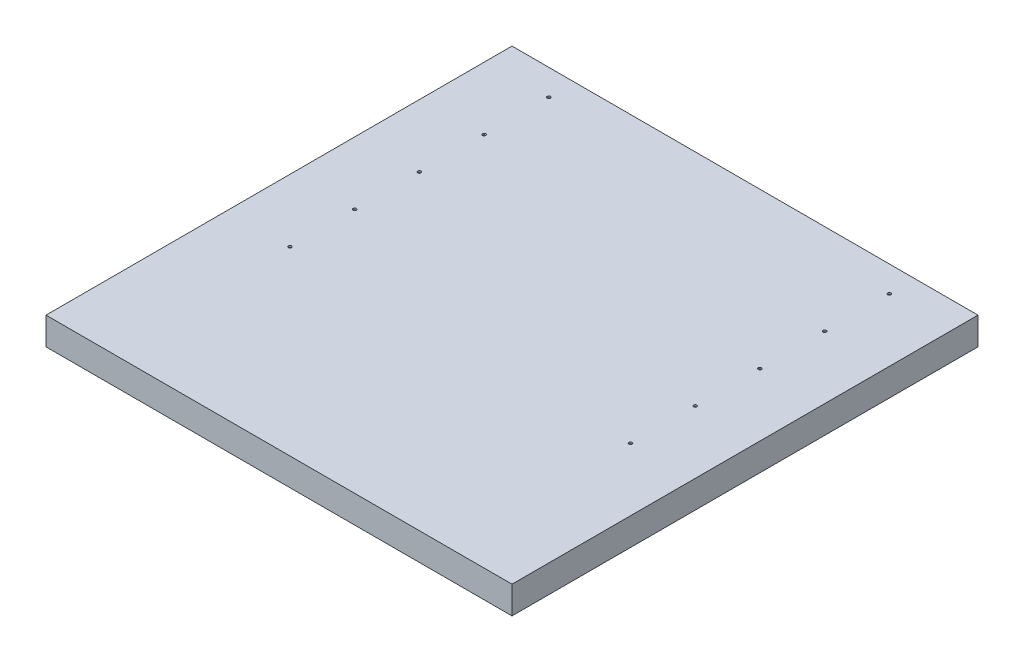
ISO-10303-21;
HEADER;
FILE_DESCRIPTION(('STEP AP214'),'2;1');
FILE_NAME('part.step','',(''),(''),'','','');
FILE_SCHEMA(('AUTOMOTIVE_DESIGN { 1 0 10303 214 1 1 1 1 }'));
ENDSEC;
DATA;
#1=APPLICATION_CONTEXT('core data for automotive mechanical design processes');
#2=APPLICATION_PROTOCOL_DEFINITION('international standard','automotive_design',2000,#1);
#3=PRODUCT_CONTEXT('',#1,'mechanical');
#4=PRODUCT('Part','Part','',(#3));
#5=PRODUCT_RELATED_PRODUCT_CATEGORY('part','',(#4));
#6=PRODUCT_DEFINITION_FORMATION('','',#4);
#7=PRODUCT_DEFINITION_CONTEXT('part definition',#1,'design');
#8=PRODUCT_DEFINITION('design','',#6,#7);
#9=PRODUCT_DEFINITION_SHAPE('','',#8);
#10=(LENGTH_UNIT() NAMED_UNIT(*) SI_UNIT(.MILLI.,.METRE.));
#11=(NAMED_UNIT(*) PLANE_ANGLE_UNIT() SI_UNIT($,.RADIAN.));
#12=(NAMED_UNIT(*) SI_UNIT($,.STERADIAN.) SOLID_ANGLE_UNIT());
#13=UNCERTAINTY_MEASURE_WITH_UNIT(LENGTH_MEASURE(1.E-05),#10,'distance_accuracy_value','');
#14=(GEOMETRIC_REPRESENTATION_CONTEXT(3) GLOBAL_UNCERTAINTY_ASSIGNED_CONTEXT((#13)) GLOBAL_UNIT_ASSIGNED_CONTEXT((#10,
#11,#12)) REPRESENTATION_CONTEXT('',''));
#15=CARTESIAN_POINT('',(0.,0.,0.));
#16=DIRECTION('',(0.,0.,1.));
#17=DIRECTION('',(1.,0.,0.));
#18=AXIS2_PLACEMENT_3D('',#15,#16,#17);
#19=CARTESIAN_POINT('',(0.,3.175,0.));
#20=DIRECTION('',(0.,-1.,0.));
#21=DIRECTION('',(0.,0.,-1.));
#22=AXIS2_PLACEMENT_3D('',#19,#20,#21);
#23=PLANE('',#22);
#24=DIRECTION('',(0.,0.,-1.));
#25=VECTOR('',#24,1.);
#26=CARTESIAN_POINT('',(457.2,3.175,457.2));
#27=LINE('',#26,#25);
#28=CARTESIAN_POINT('',(457.2,3.175,457.2));
#29=VERTEX_POINT('',#28);
#30=CARTESIAN_POINT('',(457.2,3.175,-457.2));
#31=VERTEX_POINT('',#30);
#32=EDGE_CURVE('E206',#29,#31,#27,.T.);
#33=ORIENTED_EDGE('',*,*,#32,.T.);
#34=DIRECTION('',(-1.,0.,0.));
#35=VECTOR('',#34,1.);
#36=CARTESIAN_POINT('',(-457.2,3.175,-457.2));
#37=LINE('',#36,#35);
#38=CARTESIAN_POINT('',(-457.2,3.175,-457.2));
#39=VERTEX_POINT('',#38);
#40=EDGE_CURVE('E211',#31,#39,#37,.T.);
#41=ORIENTED_EDGE('',*,*,#40,.T.);
#42=DIRECTION('',(0.,0.,1.));
#43=VECTOR('',#42,1.);
#44=CARTESIAN_POINT('',(-457.2,3.175,457.2));
#45=LINE('',#44,#43);
#46=CARTESIAN_POINT('',(-457.2,3.175,457.2));
#47=VERTEX_POINT('',#46);
#48=EDGE_CURVE('E213',#39,#47,#45,.T.);
#49=ORIENTED_EDGE('',*,*,#48,.T.);
#50=DIRECTION('',(1.,0.,0.));
#51=VECTOR('',#50,1.);
#52=CARTESIAN_POINT('',(-457.2,3.175,457.2));
#53=LINE('',#52,#51);
#54=EDGE_CURVE('E215',#47,#29,#53,.T.);
#55=ORIENTED_EDGE('',*,*,#54,.T.);
#56=EDGE_LOOP('',(#33,#41,#49,#55));
#57=FACE_BOUND('',#56,.T.);
#58=CARTESIAN_POINT('',(-334.137,3.175,-406.4));
#59=DIRECTION('',(0.,1.,0.));
#60=DIRECTION('',(0.,0.,1.));
#61=AXIS2_PLACEMENT_3D('',#58,#59,#60);
#62=CIRCLE('',#61,3.17499999999997);
#63=CARTESIAN_POINT('',(-334.137,3.175,-403.225));
#64=VERTEX_POINT('',#63);
#65=EDGE_CURVE('E203',#64,#64,#62,.T.);
#66=ORIENTED_EDGE('',*,*,#65,.F.);
#67=EDGE_LOOP('',(#66));
#68=FACE_BOUND('',#67,.T.);
#69=CARTESIAN_POINT('',(334.136999999995,3.175,101.6));
#70=DIRECTION('',(0.,1.,0.));
#71=DIRECTION('',(0.,0.,-1.));
#72=AXIS2_PLACEMENT_3D('',#69,#70,#71);
#73=CIRCLE('',#72,3.17499999999997);
#74=CARTESIAN_POINT('',(334.136999999995,3.175,98.4250000000001));
#75=VERTEX_POINT('',#74);
#76=EDGE_CURVE('E197',#75,#75,#73,.T.);
#77=ORIENTED_EDGE('',*,*,#76,.F.);
#78=EDGE_LOOP('',(#77));
#79=FACE_BOUND('',#78,.T.);
#80=CARTESIAN_POINT('',(-334.136999999999,3.175,-279.4));
#81=DIRECTION('',(0.,1.,0.));
#82=DIRECTION('',(0.,0.,1.));
#83=AXIS2_PLACEMENT_3D('',#80,#81,#82);
#84=CIRCLE('',#83,3.17499999999997);
#85=CARTESIAN_POINT('',(-334.136999999999,3.175,-276.225));
#86=VERTEX_POINT('',#85);
#87=EDGE_CURVE('E191',#86,#86,#84,.T.);
#88=ORIENTED_EDGE('',*,*,#87,.F.);
#89=EDGE_LOOP('',(#88));
#90=FACE_BOUND('',#89,.T.);
#91=CARTESIAN_POINT('',(-334.136999999997,3.175,-152.4));
#92=DIRECTION('',(0.,1.,0.));
#93=DIRECTION('',(0.,0.,1.));
#94=AXIS2_PLACEMENT_3D('',#91,#92,#93);
#95=CIRCLE('',#94,3.17499999999997);
#96=CARTESIAN_POINT('',(-334.136999999997,3.175,-149.225));
#97=VERTEX_POINT('',#96);
#98=EDGE_CURVE('E185',#97,#97,#95,.T.);
#99=ORIENTED_EDGE('',*,*,#98,.F.);
#100=EDGE_LOOP('',(#99));
#101=FACE_BOUND('',#100,.T.);
#102=CARTESIAN_POINT('',(-334.136999999996,3.175,-25.4));
#103=DIRECTION('',(0.,1.,0.));
#104=DIRECTION('',(0.,0.,1.));
#105=AXIS2_PLACEMENT_3D('',#102,#103,#104);
#106=CIRCLE('',#105,3.17499999999997);
#107=CARTESIAN_POINT('',(-334.136999999996,3.175,-22.225));
#108=VERTEX_POINT('',#107);
#109=EDGE_CURVE('E179',#108,#108,#106,.T.);
#110=ORIENTED_EDGE('',*,*,#109,.F.);
#111=EDGE_LOOP('',(#110));
#112=FACE_BOUND('',#111,.T.);
#113=CARTESIAN_POINT('',(-334.136999999995,3.175,101.6));
#114=DIRECTION('',(0.,1.,0.));
#115=DIRECTION('',(0.,0.,1.));
#116=AXIS2_PLACEMENT_3D('',#113,#114,#115);
#117=CIRCLE('',#116,3.17499999999997);
#118=CARTESIAN_POINT('',(-334.136999999995,3.175,104.775));
#119=VERTEX_POINT('',#118);
#120=EDGE_CURVE('E173',#119,#119,#117,.T.);
#121=ORIENTED_EDGE('',*,*,#120,.F.);
#122=EDGE_LOOP('',(#121));
#123=FACE_BOUND('',#122,.T.);
#124=CARTESIAN_POINT('',(334.136999999996,3.175,-25.4));
#125=DIRECTION('',(0.,1.,0.));
#126=DIRECTION('',(0.,0.,-1.));
#127=AXIS2_PLACEMENT_3D('',#124,#125,#126);
#128=CIRCLE('',#127,3.17499999999997);
#129=CARTESIAN_POINT('',(334.136999999996,3.175,-28.5749999999999));
#130=VERTEX_POINT('',#129);
#131=EDGE_CURVE('E167',#130,#130,#128,.T.);
#132=ORIENTED_EDGE('',*,*,#131,.F.);
#133=EDGE_LOOP('',(#132));
#134=FACE_BOUND('',#133,.T.);
#135=CARTESIAN_POINT('',(334.136999999997,3.175,-152.4));
#136=DIRECTION('',(0.,1.,0.));
#137=DIRECTION('',(0.,0.,-1.));
#138=AXIS2_PLACEMENT_3D('',#135,#136,#137);
#139=CIRCLE('',#138,3.17499999999997);
#140=CARTESIAN_POINT('',(334.136999999997,3.175,-155.575));
#141=VERTEX_POINT('',#140);
#142=EDGE_CURVE('E161',#141,#141,#139,.T.);
#143=ORIENTED_EDGE('',*,*,#142,.F.);
#144=EDGE_LOOP('',(#143));
#145=FACE_BOUND('',#144,.T.);
#146=CARTESIAN_POINT('',(334.136999999999,3.175,-279.4));
#147=DIRECTION('',(0.,1.,0.));
#148=DIRECTION('',(0.,0.,-1.));
#149=AXIS2_PLACEMENT_3D('',#146,#147,#148);
#150=CIRCLE('',#149,3.17499999999997);
#151=CARTESIAN_POINT('',(334.136999999999,3.175,-282.575));
#152=VERTEX_POINT('',#151);
#153=EDGE_CURVE('E155',#152,#152,#150,.T.);
#154=ORIENTED_EDGE('',*,*,#153,.F.);
#155=EDGE_LOOP('',(#154));
#156=FACE_BOUND('',#155,.T.);
#157=CARTESIAN_POINT('',(334.137,3.175,-406.4));
#158=DIRECTION('',(0.,1.,0.));
#159=DIRECTION('',(0.,0.,-1.));
#160=AXIS2_PLACEMENT_3D('',#157,#158,#159);
#161=CIRCLE('',#160,3.17499999999997);
#162=CARTESIAN_POINT('',(334.137,3.175,-409.575));
#163=VERTEX_POINT('',#162);
#164=EDGE_CURVE('E149',#163,#163,#161,.T.);
#165=ORIENTED_EDGE('',*,*,#164,.F.);
#166=EDGE_LOOP('',(#165));
#167=FACE_BOUND('',#166,.T.);
#168=ADVANCED_FACE('F37',(#57,#68,#79,#90,#101,#112,#123,#134,#145,#156,#167),#23,.F.);
#169=CARTESIAN_POINT('',(0.,0.,0.));
#170=DIRECTION('',(0.,-1.,0.));
#171=DIRECTION('',(0.,0.,-1.));
#172=AXIS2_PLACEMENT_3D('',#169,#170,#171);
#173=PLANE('',#172);
#174=DIRECTION('',(0.,0.,-1.));
#175=VECTOR('',#174,1.);
#176=CARTESIAN_POINT('',(-454.025,0.,-454.025));
#177=LINE('',#176,#175);
#178=CARTESIAN_POINT('',(-454.025,0.,454.025));
#179=VERTEX_POINT('',#178);
#180=CARTESIAN_POINT('',(-454.025,0.,-454.025));
#181=VERTEX_POINT('',#180);
#182=EDGE_CURVE('E52',#179,#181,#177,.T.);
#183=ORIENTED_EDGE('',*,*,#182,.T.);
#184=DIRECTION('',(1.,0.,0.));
#185=VECTOR('',#184,1.);
#186=CARTESIAN_POINT('',(454.025,0.,-454.025));
#187=LINE('',#186,#185);
#188=CARTESIAN_POINT('',(454.025,0.,-454.025));
#189=VERTEX_POINT('',#188);
#190=EDGE_CURVE('E56',#181,#189,#187,.T.);
#191=ORIENTED_EDGE('',*,*,#190,.T.);
#192=DIRECTION('',(0.,0.,1.));
#193=VECTOR('',#192,1.);
#194=CARTESIAN_POINT('',(454.025,0.,454.025));
#195=LINE('',#194,#193);
#196=CARTESIAN_POINT('',(454.025,0.,454.025));
#197=VERTEX_POINT('',#196);
#198=EDGE_CURVE('E129',#189,#197,#195,.T.);
#199=ORIENTED_EDGE('',*,*,#198,.T.);
#200=DIRECTION('',(-1.,0.,0.));
#201=VECTOR('',#200,1.);
#202=CARTESIAN_POINT('',(-454.025,0.,454.025));
#203=LINE('',#202,#201);
#204=EDGE_CURVE('E110',#197,#179,#203,.T.);
#205=ORIENTED_EDGE('',*,*,#204,.T.);
#206=EDGE_LOOP('',(#183,#191,#199,#205));
#207=FACE_BOUND('',#206,.T.);
#208=CARTESIAN_POINT('',(334.136999999999,0.,-279.4));
#209=DIRECTION('',(0.,1.,0.));
#210=DIRECTION('',(0.,0.,-1.));
#211=AXIS2_PLACEMENT_3D('',#208,#209,#210);
#212=CIRCLE('',#211,3.17499999999997);
#213=CARTESIAN_POINT('',(334.136999999999,0.,-282.575));
#214=VERTEX_POINT('',#213);
#215=EDGE_CURVE('E152',#214,#214,#212,.T.);
#216=ORIENTED_EDGE('',*,*,#215,.T.);
#217=EDGE_LOOP('',(#216));
#218=FACE_BOUND('',#217,.T.);
#219=CARTESIAN_POINT('',(334.136999999996,0.,-25.4));
#220=DIRECTION('',(0.,1.,0.));
#221=DIRECTION('',(0.,0.,-1.));
#222=AXIS2_PLACEMENT_3D('',#219,#220,#221);
#223=CIRCLE('',#222,3.17499999999997);
#224=CARTESIAN_POINT('',(334.136999999996,0.,-28.5749999999999));
#225=VERTEX_POINT('',#224);
#226=EDGE_CURVE('E164',#225,#225,#223,.T.);
#227=ORIENTED_EDGE('',*,*,#226,.T.);
#228=EDGE_LOOP('',(#227));
#229=FACE_BOUND('',#228,.T.);
#230=CARTESIAN_POINT('',(-334.136999999996,0.,-25.4));
#231=DIRECTION('',(0.,1.,0.));
#232=DIRECTION('',(0.,0.,1.));
#233=AXIS2_PLACEMENT_3D('',#230,#231,#232);
#234=CIRCLE('',#233,3.17499999999997);
#235=CARTESIAN_POINT('',(-334.136999999996,0.,-22.225));
#236=VERTEX_POINT('',#235);
#237=EDGE_CURVE('E176',#236,#236,#234,.T.);
#238=ORIENTED_EDGE('',*,*,#237,.T.);
#239=EDGE_LOOP('',(#238));
#240=FACE_BOUND('',#239,.T.);
#241=CARTESIAN_POINT('',(-334.136999999999,0.,-279.4));
#242=DIRECTION('',(0.,1.,0.));
#243=DIRECTION('',(0.,0.,1.));
#244=AXIS2_PLACEMENT_3D('',#241,#242,#243);
#245=CIRCLE('',#244,3.17499999999997);
#246=CARTESIAN_POINT('',(-334.136999999999,0.,-276.225));
#247=VERTEX_POINT('',#246);
#248=EDGE_CURVE('E188',#247,#247,#245,.T.);
#249=ORIENTED_EDGE('',*,*,#248,.T.);
#250=EDGE_LOOP('',(#249));
#251=FACE_BOUND('',#250,.T.);
#252=CARTESIAN_POINT('',(-334.137,0.,-406.4));
#253=DIRECTION('',(0.,1.,0.));
#254=DIRECTION('',(0.,0.,1.));
#255=AXIS2_PLACEMENT_3D('',#252,#253,#254);
#256=CIRCLE('',#255,3.17499999999997);
#257=CARTESIAN_POINT('',(-334.137,0.,-403.225));
#258=VERTEX_POINT('',#257);
#259=EDGE_CURVE('E200',#258,#258,#256,.T.);
#260=ORIENTED_EDGE('',*,*,#259,.T.);
#261=EDGE_LOOP('',(#260));
#262=FACE_BOUND('',#261,.T.);
#263=CARTESIAN_POINT('',(334.136999999995,0.,101.6));
#264=DIRECTION('',(0.,1.,0.));
#265=DIRECTION('',(0.,0.,-1.));
#266=AXIS2_PLACEMENT_3D('',#263,#264,#265);
#267=CIRCLE('',#266,3.17499999999997);
#268=CARTESIAN_POINT('',(334.136999999995,0.,98.4250000000001));
#269=VERTEX_POINT('',#268);
#270=EDGE_CURVE('E194',#269,#269,#267,.T.);
#271=ORIENTED_EDGE('',*,*,#270,.T.);
#272=EDGE_LOOP('',(#271));
#273=FACE_BOUND('',#272,.T.);
#274=CARTESIAN_POINT('',(-334.136999999997,0.,-152.4));
#275=DIRECTION('',(0.,1.,0.));
#276=DIRECTION('',(0.,0.,1.));
#277=AXIS2_PLACEMENT_3D('',#274,#275,#276);
#278=CIRCLE('',#277,3.17499999999997);
#279=CARTESIAN_POINT('',(-334.136999999997,0.,-149.225));
#280=VERTEX_POINT('',#279);
#281=EDGE_CURVE('E182',#280,#280,#278,.T.);
#282=ORIENTED_EDGE('',*,*,#281,.T.);
#283=EDGE_LOOP('',(#282));
#284=FACE_BOUND('',#283,.T.);
#285=CARTESIAN_POINT('',(-334.136999999995,0.,101.6));
#286=DIRECTION('',(0.,1.,0.));
#287=DIRECTION('',(0.,0.,1.));
#288=AXIS2_PLACEMENT_3D('',#285,#286,#287);
#289=CIRCLE('',#288,3.17499999999997);
#290=CARTESIAN_POINT('',(-334.136999999995,0.,104.775));
#291=VERTEX_POINT('',#290);
#292=EDGE_CURVE('E170',#291,#291,#289,.T.);
#293=ORIENTED_EDGE('',*,*,#292,.T.);
#294=EDGE_LOOP('',(#293));
#295=FACE_BOUND('',#294,.T.);
#296=CARTESIAN_POINT('',(334.136999999997,0.,-152.4));
#297=DIRECTION('',(0.,1.,0.));
#298=DIRECTION('',(0.,0.,-1.));
#299=AXIS2_PLACEMENT_3D('',#296,#297,#298);
#300=CIRCLE('',#299,3.17499999999997);
#301=CARTESIAN_POINT('',(334.136999999997,0.,-155.575));
#302=VERTEX_POINT('',#301);
#303=EDGE_CURVE('E158',#302,#302,#300,.T.);
#304=ORIENTED_EDGE('',*,*,#303,.T.);
#305=EDGE_LOOP('',(#304));
#306=FACE_BOUND('',#305,.T.);
#307=CARTESIAN_POINT('',(334.137,0.,-406.4));
#308=DIRECTION('',(0.,1.,0.));
#309=DIRECTION('',(0.,0.,-1.));
#310=AXIS2_PLACEMENT_3D('',#307,#308,#309);
#311=CIRCLE('',#310,3.17499999999997);
#312=CARTESIAN_POINT('',(334.137,0.,-409.575));
#313=VERTEX_POINT('',#312);
#314=EDGE_CURVE('E148',#313,#313,#311,.T.);
#315=ORIENTED_EDGE('',*,*,#314,.T.);
#316=EDGE_LOOP('',(#315));
#317=FACE_BOUND('',#316,.T.);
#318=ADVANCED_FACE('F242',(#207,#218,#229,#240,#251,#262,#273,#284,#295,#306,#317),#173,.T.);
#319=CARTESIAN_POINT('',(457.2,3.175,457.2));
#320=DIRECTION('',(-1.,0.,0.));
#321=DIRECTION('',(0.,0.,1.));
#322=AXIS2_PLACEMENT_3D('',#319,#320,#321);
#323=PLANE('',#322);
#324=DIRECTION('',(0.,-1.,0.));
#325=VECTOR('',#324,1.);
#326=CARTESIAN_POINT('',(457.2,3.175,457.2));
#327=LINE('',#326,#325);
#328=CARTESIAN_POINT('',(457.2,-50.8,457.2));
#329=VERTEX_POINT('',#328);
#330=EDGE_CURVE('E217',#29,#329,#327,.T.);
#331=ORIENTED_EDGE('',*,*,#330,.T.);
#332=DIRECTION('',(0.,0.,1.));
#333=VECTOR('',#332,1.);
#334=CARTESIAN_POINT('',(457.2,-50.8,457.2));
#335=LINE('',#334,#333);
#336=CARTESIAN_POINT('',(457.2,-50.8,-457.2));
#337=VERTEX_POINT('',#336);
#338=EDGE_CURVE('E145',#337,#329,#335,.T.);
#339=ORIENTED_EDGE('',*,*,#338,.F.);
#340=DIRECTION('',(0.,-1.,0.));
#341=VECTOR('',#340,1.);
#342=CARTESIAN_POINT('',(457.2,3.175,-457.2));
#343=LINE('',#342,#341);
#344=EDGE_CURVE('E11',#31,#337,#343,.T.);
#345=ORIENTED_EDGE('',*,*,#344,.F.);
#346=ORIENTED_EDGE('',*,*,#32,.F.);
#347=EDGE_LOOP('',(#331,#339,#345,#346));
#348=FACE_BOUND('',#347,.T.);
#349=ADVANCED_FACE('F39',(#348),#323,.F.);
#350=CARTESIAN_POINT('',(-457.2,3.175,-457.2));
#351=DIRECTION('',(0.,0.,1.));
#352=DIRECTION('',(1.,0.,0.));
#353=AXIS2_PLACEMENT_3D('',#350,#351,#352);
#354=PLANE('',#353);
#355=ORIENTED_EDGE('',*,*,#344,.T.);
#356=DIRECTION('',(1.,0.,0.));
#357=VECTOR('',#356,1.);
#358=CARTESIAN_POINT('',(457.2,-50.8,-457.2));
#359=LINE('',#358,#357);
#360=CARTESIAN_POINT('',(-457.2,-50.8,-457.2));
#361=VERTEX_POINT('',#360);
#362=EDGE_CURVE('E142',#361,#337,#359,.T.);
#363=ORIENTED_EDGE('',*,*,#362,.F.);
#364=DIRECTION('',(0.,-1.,0.));
#365=VECTOR('',#364,1.);
#366=CARTESIAN_POINT('',(-457.2,3.175,-457.2));
#367=LINE('',#366,#365);
#368=EDGE_CURVE('E45',#39,#361,#367,.T.);
#369=ORIENTED_EDGE('',*,*,#368,.F.);
#370=ORIENTED_EDGE('',*,*,#40,.F.);
#371=EDGE_LOOP('',(#355,#363,#369,#370));
#372=FACE_BOUND('',#371,.T.);
#373=ADVANCED_FACE('F231',(#372),#354,.F.);
#374=CARTESIAN_POINT('',(-457.2,3.175,457.2));
#375=DIRECTION('',(1.,0.,0.));
#376=DIRECTION('',(0.,0.,-1.));
#377=AXIS2_PLACEMENT_3D('',#374,#375,#376);
#378=PLANE('',#377);
#379=ORIENTED_EDGE('',*,*,#368,.T.);
#380=DIRECTION('',(0.,0.,-1.));
#381=VECTOR('',#380,1.);
#382=CARTESIAN_POINT('',(-457.2,-50.8,-457.2));
#383=LINE('',#382,#381);
#384=CARTESIAN_POINT('',(-457.2,-50.8,457.2));
#385=VERTEX_POINT('',#384);
#386=EDGE_CURVE('E139',#385,#361,#383,.T.);
#387=ORIENTED_EDGE('',*,*,#386,.F.);
#388=DIRECTION('',(0.,-1.,0.));
#389=VECTOR('',#388,1.);
#390=CARTESIAN_POINT('',(-457.2,3.175,457.2));
#391=LINE('',#390,#389);
#392=EDGE_CURVE('E219',#47,#385,#391,.T.);
#393=ORIENTED_EDGE('',*,*,#392,.F.);
#394=ORIENTED_EDGE('',*,*,#48,.F.);
#395=EDGE_LOOP('',(#379,#387,#393,#394));
#396=FACE_BOUND('',#395,.T.);
#397=ADVANCED_FACE('F224',(#396),#378,.F.);
#398=CARTESIAN_POINT('',(-457.2,3.175,457.2));
#399=DIRECTION('',(0.,0.,-1.));
#400=DIRECTION('',(-1.,0.,0.));
#401=AXIS2_PLACEMENT_3D('',#398,#399,#400);
#402=PLANE('',#401);
#403=ORIENTED_EDGE('',*,*,#392,.T.);
#404=DIRECTION('',(-1.,0.,0.));
#405=VECTOR('',#404,1.);
#406=CARTESIAN_POINT('',(-457.2,-50.8,457.2));
#407=LINE('',#406,#405);
#408=EDGE_CURVE('E115',#329,#385,#407,.T.);
#409=ORIENTED_EDGE('',*,*,#408,.F.);
#410=ORIENTED_EDGE('',*,*,#330,.F.);
#411=ORIENTED_EDGE('',*,*,#54,.F.);
#412=EDGE_LOOP('',(#403,#409,#410,#411));
#413=FACE_BOUND('',#412,.T.);
#414=ADVANCED_FACE('F237',(#413),#402,.F.);
#415=CARTESIAN_POINT('',(-334.137,3.175,-406.4));
#416=DIRECTION('',(0.,-1.,0.));
#417=DIRECTION('',(0.,0.,-1.));
#418=AXIS2_PLACEMENT_3D('',#415,#416,#417);
#419=CYLINDRICAL_SURFACE('',#418,3.17499999999997);
#420=ORIENTED_EDGE('',*,*,#65,.T.);
#421=EDGE_LOOP('',(#420));
#422=FACE_BOUND('',#421,.T.);
#423=ORIENTED_EDGE('',*,*,#259,.F.);
#424=EDGE_LOOP('',(#423));
#425=FACE_BOUND('',#424,.T.);
#426=ADVANCED_FACE('F281',(#422,#425),#419,.F.);
#427=CARTESIAN_POINT('',(334.136999999995,3.175,101.6));
#428=DIRECTION('',(0.,-1.,0.));
#429=DIRECTION('',(0.,0.,-1.));
#430=AXIS2_PLACEMENT_3D('',#427,#428,#429);
#431=CYLINDRICAL_SURFACE('',#430,3.17499999999997);
#432=ORIENTED_EDGE('',*,*,#76,.T.);
#433=EDGE_LOOP('',(#432));
#434=FACE_BOUND('',#433,.T.);
#435=ORIENTED_EDGE('',*,*,#270,.F.);
#436=EDGE_LOOP('',(#435));
#437=FACE_BOUND('',#436,.T.);
#438=ADVANCED_FACE('F303',(#434,#437),#431,.F.);
#439=CARTESIAN_POINT('',(-334.136999999999,3.175,-279.4));
#440=DIRECTION('',(0.,-1.,0.));
#441=DIRECTION('',(0.,0.,-1.));
#442=AXIS2_PLACEMENT_3D('',#439,#440,#441);
#443=CYLINDRICAL_SURFACE('',#442,3.17499999999997);
#444=ORIENTED_EDGE('',*,*,#87,.T.);
#445=EDGE_LOOP('',(#444));
#446=FACE_BOUND('',#445,.T.);
#447=ORIENTED_EDGE('',*,*,#248,.F.);
#448=EDGE_LOOP('',(#447));
#449=FACE_BOUND('',#448,.T.);
#450=ADVANCED_FACE('F311',(#446,#449),#443,.F.);
#451=CARTESIAN_POINT('',(-334.136999999997,3.175,-152.4));
#452=DIRECTION('',(0.,-1.,0.));
#453=DIRECTION('',(0.,0.,-1.));
#454=AXIS2_PLACEMENT_3D('',#451,#452,#453);
#455=CYLINDRICAL_SURFACE('',#454,3.17499999999997);
#456=ORIENTED_EDGE('',*,*,#98,.T.);
#457=EDGE_LOOP('',(#456));
#458=FACE_BOUND('',#457,.T.);
#459=ORIENTED_EDGE('',*,*,#281,.F.);
#460=EDGE_LOOP('',(#459));
#461=FACE_BOUND('',#460,.T.);
#462=ADVANCED_FACE('F319',(#458,#461),#455,.F.);
#463=CARTESIAN_POINT('',(-334.136999999996,3.175,-25.4));
#464=DIRECTION('',(0.,-1.,0.));
#465=DIRECTION('',(0.,0.,-1.));
#466=AXIS2_PLACEMENT_3D('',#463,#464,#465);
#467=CYLINDRICAL_SURFACE('',#466,3.17499999999997);
#468=ORIENTED_EDGE('',*,*,#109,.T.);
#469=EDGE_LOOP('',(#468));
#470=FACE_BOUND('',#469,.T.);
#471=ORIENTED_EDGE('',*,*,#237,.F.);
#472=EDGE_LOOP('',(#471));
#473=FACE_BOUND('',#472,.T.);
#474=ADVANCED_FACE('F327',(#470,#473),#467,.F.);
#475=CARTESIAN_POINT('',(-334.136999999995,3.175,101.6));
#476=DIRECTION('',(0.,-1.,0.));
#477=DIRECTION('',(0.,0.,-1.));
#478=AXIS2_PLACEMENT_3D('',#475,#476,#477);
#479=CYLINDRICAL_SURFACE('',#478,3.17499999999997);
#480=ORIENTED_EDGE('',*,*,#120,.T.);
#481=EDGE_LOOP('',(#480));
#482=FACE_BOUND('',#481,.T.);
#483=ORIENTED_EDGE('',*,*,#292,.F.);
#484=EDGE_LOOP('',(#483));
#485=FACE_BOUND('',#484,.T.);
#486=ADVANCED_FACE('F335',(#482,#485),#479,.F.);
#487=CARTESIAN_POINT('',(334.136999999996,3.175,-25.4));
#488=DIRECTION('',(0.,-1.,0.));
#489=DIRECTION('',(0.,0.,-1.));
#490=AXIS2_PLACEMENT_3D('',#487,#488,#489);
#491=CYLINDRICAL_SURFACE('',#490,3.17499999999997);
#492=ORIENTED_EDGE('',*,*,#131,.T.);
#493=EDGE_LOOP('',(#492));
#494=FACE_BOUND('',#493,.T.);
#495=ORIENTED_EDGE('',*,*,#226,.F.);
#496=EDGE_LOOP('',(#495));
#497=FACE_BOUND('',#496,.T.);
#498=ADVANCED_FACE('F343',(#494,#497),#491,.F.);
#499=CARTESIAN_POINT('',(334.136999999997,3.175,-152.4));
#500=DIRECTION('',(0.,-1.,0.));
#501=DIRECTION('',(0.,0.,-1.));
#502=AXIS2_PLACEMENT_3D('',#499,#500,#501);
#503=CYLINDRICAL_SURFACE('',#502,3.17499999999997);
#504=ORIENTED_EDGE('',*,*,#142,.T.);
#505=EDGE_LOOP('',(#504));
#506=FACE_BOUND('',#505,.T.);
#507=ORIENTED_EDGE('',*,*,#303,.F.);
#508=EDGE_LOOP('',(#507));
#509=FACE_BOUND('',#508,.T.);
#510=ADVANCED_FACE('F351',(#506,#509),#503,.F.);
#511=CARTESIAN_POINT('',(334.136999999999,3.175,-279.4));
#512=DIRECTION('',(0.,-1.,0.));
#513=DIRECTION('',(0.,0.,-1.));
#514=AXIS2_PLACEMENT_3D('',#511,#512,#513);
#515=CYLINDRICAL_SURFACE('',#514,3.17499999999997);
#516=ORIENTED_EDGE('',*,*,#153,.T.);
#517=EDGE_LOOP('',(#516));
#518=FACE_BOUND('',#517,.T.);
#519=ORIENTED_EDGE('',*,*,#215,.F.);
#520=EDGE_LOOP('',(#519));
#521=FACE_BOUND('',#520,.T.);
#522=ADVANCED_FACE('F267',(#518,#521),#515,.F.);
#523=CARTESIAN_POINT('',(334.137,3.175,-406.4));
#524=DIRECTION('',(0.,-1.,0.));
#525=DIRECTION('',(0.,0.,-1.));
#526=AXIS2_PLACEMENT_3D('',#523,#524,#525);
#527=CYLINDRICAL_SURFACE('',#526,3.17499999999997);
#528=ORIENTED_EDGE('',*,*,#164,.T.);
#529=EDGE_LOOP('',(#528));
#530=FACE_BOUND('',#529,.T.);
#531=ORIENTED_EDGE('',*,*,#314,.F.);
#532=EDGE_LOOP('',(#531));
#533=FACE_BOUND('',#532,.T.);
#534=ADVANCED_FACE('F264',(#530,#533),#527,.F.);
#535=CARTESIAN_POINT('',(0.,-50.8,0.));
#536=DIRECTION('',(0.,1.,0.));
#537=DIRECTION('',(0.,0.,1.));
#538=AXIS2_PLACEMENT_3D('',#535,#536,#537);
#539=PLANE('',#538);
#540=ORIENTED_EDGE('',*,*,#408,.T.);
#541=ORIENTED_EDGE('',*,*,#386,.T.);
#542=ORIENTED_EDGE('',*,*,#362,.T.);
#543=ORIENTED_EDGE('',*,*,#338,.T.);
#544=EDGE_LOOP('',(#540,#541,#542,#543));
#545=FACE_BOUND('',#544,.T.);
#546=DIRECTION('',(0.,0.,-1.));
#547=VECTOR('',#546,1.);
#548=CARTESIAN_POINT('',(-454.025,-50.8,-454.025));
#549=LINE('',#548,#547);
#550=CARTESIAN_POINT('',(-454.025,-50.8,454.025));
#551=VERTEX_POINT('',#550);
#552=CARTESIAN_POINT('',(-454.025,-50.8,-454.025));
#553=VERTEX_POINT('',#552);
#554=EDGE_CURVE('E100',#551,#553,#549,.T.);
#555=ORIENTED_EDGE('',*,*,#554,.F.);
#556=DIRECTION('',(-1.,0.,0.));
#557=VECTOR('',#556,1.);
#558=CARTESIAN_POINT('',(-454.025,-50.8,454.025));
#559=LINE('',#558,#557);
#560=CARTESIAN_POINT('',(454.025,-50.8,454.025));
#561=VERTEX_POINT('',#560);
#562=EDGE_CURVE('E123',#561,#551,#559,.T.);
#563=ORIENTED_EDGE('',*,*,#562,.F.);
#564=DIRECTION('',(0.,0.,1.));
#565=VECTOR('',#564,1.);
#566=CARTESIAN_POINT('',(454.025,-50.8,454.025));
#567=LINE('',#566,#565);
#568=CARTESIAN_POINT('',(454.025,-50.8,-454.025));
#569=VERTEX_POINT('',#568);
#570=EDGE_CURVE('E121',#569,#561,#567,.T.);
#571=ORIENTED_EDGE('',*,*,#570,.F.);
#572=DIRECTION('',(1.,0.,0.));
#573=VECTOR('',#572,1.);
#574=CARTESIAN_POINT('',(454.025,-50.8,-454.025));
#575=LINE('',#574,#573);
#576=EDGE_CURVE('E109',#553,#569,#575,.T.);
#577=ORIENTED_EDGE('',*,*,#576,.F.);
#578=EDGE_LOOP('',(#555,#563,#571,#577));
#579=FACE_BOUND('',#578,.T.);
#580=ADVANCED_FACE('F119',(#545,#579),#539,.F.);
#581=CARTESIAN_POINT('',(-454.025,-50.8,-454.025));
#582=DIRECTION('',(1.,0.,0.));
#583=DIRECTION('',(0.,0.,-1.));
#584=AXIS2_PLACEMENT_3D('',#581,#582,#583);
#585=PLANE('',#584);
#586=ORIENTED_EDGE('',*,*,#182,.F.);
#587=DIRECTION('',(0.,1.,0.));
#588=VECTOR('',#587,1.);
#589=CARTESIAN_POINT('',(-454.025,-50.8,454.025));
#590=LINE('',#589,#588);
#591=EDGE_CURVE('E105',#551,#179,#590,.T.);
#592=ORIENTED_EDGE('',*,*,#591,.F.);
#593=ORIENTED_EDGE('',*,*,#554,.T.);
#594=DIRECTION('',(0.,1.,0.));
#595=VECTOR('',#594,1.);
#596=CARTESIAN_POINT('',(-454.025,-50.8,-454.025));
#597=LINE('',#596,#595);
#598=EDGE_CURVE('E103',#553,#181,#597,.T.);
#599=ORIENTED_EDGE('',*,*,#598,.T.);
#600=EDGE_LOOP('',(#586,#592,#593,#599));
#601=FACE_BOUND('',#600,.T.);
#602=ADVANCED_FACE('F102',(#601),#585,.T.);
#603=CARTESIAN_POINT('',(454.025,-50.8,-454.025));
#604=DIRECTION('',(0.,0.,1.));
#605=DIRECTION('',(1.,0.,0.));
#606=AXIS2_PLACEMENT_3D('',#603,#604,#605);
#607=PLANE('',#606);
#608=ORIENTED_EDGE('',*,*,#190,.F.);
#609=ORIENTED_EDGE('',*,*,#598,.F.);
#610=ORIENTED_EDGE('',*,*,#576,.T.);
#611=DIRECTION('',(0.,1.,0.));
#612=VECTOR('',#611,1.);
#613=CARTESIAN_POINT('',(454.025,-50.8,-454.025));
#614=LINE('',#613,#612);
#615=EDGE_CURVE('E116',#569,#189,#614,.T.);
#616=ORIENTED_EDGE('',*,*,#615,.T.);
#617=EDGE_LOOP('',(#608,#609,#610,#616));
#618=FACE_BOUND('',#617,.T.);
#619=ADVANCED_FACE('F113',(#618),#607,.T.);
#620=CARTESIAN_POINT('',(454.025,-50.8,454.025));
#621=DIRECTION('',(-1.,0.,0.));
#622=DIRECTION('',(0.,0.,1.));
#623=AXIS2_PLACEMENT_3D('',#620,#621,#622);
#624=PLANE('',#623);
#625=ORIENTED_EDGE('',*,*,#198,.F.);
#626=ORIENTED_EDGE('',*,*,#615,.F.);
#627=ORIENTED_EDGE('',*,*,#570,.T.);
#628=DIRECTION('',(0.,1.,0.));
#629=VECTOR('',#628,1.);
#630=CARTESIAN_POINT('',(454.025,-50.8,454.025));
#631=LINE('',#630,#629);
#632=EDGE_CURVE('E133',#561,#197,#631,.T.);
#633=ORIENTED_EDGE('',*,*,#632,.T.);
#634=EDGE_LOOP('',(#625,#626,#627,#633));
#635=FACE_BOUND('',#634,.T.);
#636=ADVANCED_FACE('F388',(#635),#624,.T.);
#637=CARTESIAN_POINT('',(-454.025,-50.8,454.025));
#638=DIRECTION('',(0.,0.,-1.));
#639=DIRECTION('',(-1.,0.,0.));
#640=AXIS2_PLACEMENT_3D('',#637,#638,#639);
#641=PLANE('',#640);
#642=ORIENTED_EDGE('',*,*,#204,.F.);
#643=ORIENTED_EDGE('',*,*,#632,.F.);
#644=ORIENTED_EDGE('',*,*,#562,.T.);
#645=ORIENTED_EDGE('',*,*,#591,.T.);
#646=EDGE_LOOP('',(#642,#643,#644,#645));
#647=FACE_BOUND('',#646,.T.);
#648=ADVANCED_FACE('F395',(#647),#641,.T.);
#649=CLOSED_SHELL('',(#168,#318,#349,#373,#397,#414,#426,#438,#450,#462,#474,#486,#498,#510,
#522,#534,#580,#602,#619,#636,#648));
#650=MANIFOLD_SOLID_BREP('B2',#649);
#651=ADVANCED_BREP_SHAPE_REPRESENTATION('',(#18,#650),#14);
#652=SHAPE_DEFINITION_REPRESENTATION(#9,#651);
ENDSEC;
END-ISO-10303-21;
